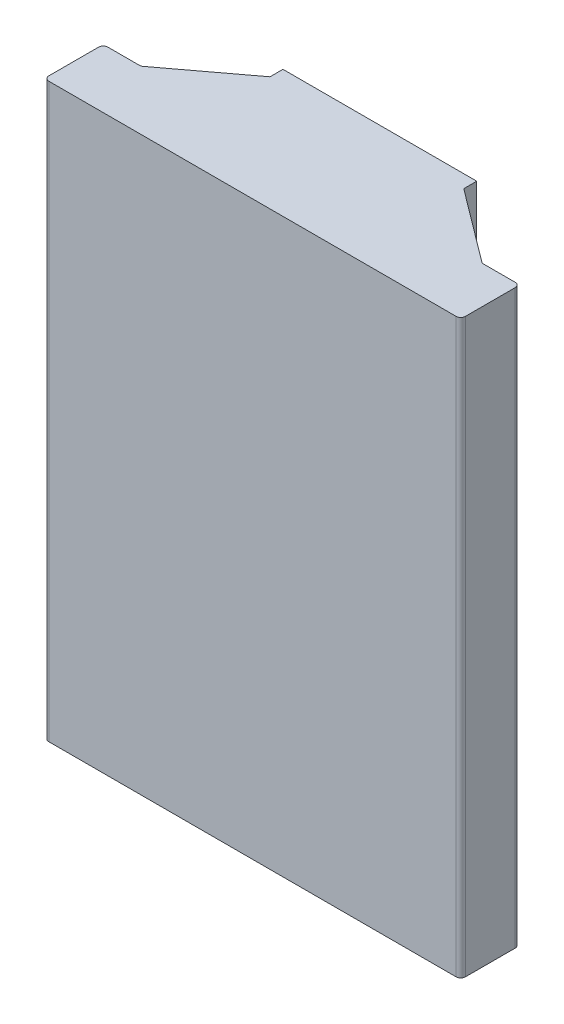
ISO-10303-21;
HEADER;
FILE_DESCRIPTION(('STEP AP214'),'2;1');
FILE_NAME('part.step','',(''),(''),'','','');
FILE_SCHEMA(('AUTOMOTIVE_DESIGN { 1 0 10303 214 1 1 1 1 }'));
ENDSEC;
DATA;
#1=APPLICATION_CONTEXT('core data for automotive mechanical design processes');
#2=APPLICATION_PROTOCOL_DEFINITION('international standard','automotive_design',2000,#1);
#3=PRODUCT_CONTEXT('',#1,'mechanical');
#4=PRODUCT('Part','Part','',(#3));
#5=PRODUCT_RELATED_PRODUCT_CATEGORY('part','',(#4));
#6=PRODUCT_DEFINITION_FORMATION('','',#4);
#7=PRODUCT_DEFINITION_CONTEXT('part definition',#1,'design');
#8=PRODUCT_DEFINITION('design','',#6,#7);
#9=PRODUCT_DEFINITION_SHAPE('','',#8);
#10=(LENGTH_UNIT() NAMED_UNIT(*) SI_UNIT(.MILLI.,.METRE.));
#11=(NAMED_UNIT(*) PLANE_ANGLE_UNIT() SI_UNIT($,.RADIAN.));
#12=(NAMED_UNIT(*) SI_UNIT($,.STERADIAN.) SOLID_ANGLE_UNIT());
#13=UNCERTAINTY_MEASURE_WITH_UNIT(LENGTH_MEASURE(1.E-05),#10,'distance_accuracy_value','');
#14=(GEOMETRIC_REPRESENTATION_CONTEXT(3) GLOBAL_UNCERTAINTY_ASSIGNED_CONTEXT((#13)) GLOBAL_UNIT_ASSIGNED_CONTEXT((#10,
#11,#12)) REPRESENTATION_CONTEXT('',''));
#15=CARTESIAN_POINT('',(0.,0.,0.));
#16=DIRECTION('',(0.,0.,1.));
#17=DIRECTION('',(1.,0.,0.));
#18=AXIS2_PLACEMENT_3D('',#15,#16,#17);
#19=CARTESIAN_POINT('',(20.575,60.,-2.40000000000001));
#20=DIRECTION('',(0.,0.,-1.));
#21=DIRECTION('',(-1.,0.,0.));
#22=AXIS2_PLACEMENT_3D('',#19,#20,#21);
#23=PLANE('',#22);
#24=DIRECTION('',(1.,0.,0.));
#25=VECTOR('',#24,1.);
#26=CARTESIAN_POINT('',(20.575,0.,-2.40000000000001));
#27=LINE('',#26,#25);
#28=CARTESIAN_POINT('',(17.825,0.,-2.40000000000001));
#29=VERTEX_POINT('',#28);
#30=CARTESIAN_POINT('',(20.075,0.,-2.40000000000001));
#31=VERTEX_POINT('',#30);
#32=EDGE_CURVE('E301',#29,#31,#27,.T.);
#33=ORIENTED_EDGE('',*,*,#32,.T.);
#34=DIRECTION('',(0.,-1.,0.));
#35=VECTOR('',#34,1.);
#36=CARTESIAN_POINT('',(20.075,60.,-2.40000000000001));
#37=LINE('',#36,#35);
#38=CARTESIAN_POINT('',(20.075,60.,-2.40000000000001));
#39=VERTEX_POINT('',#38);
#40=EDGE_CURVE('E525',#31,#39,#37,.F.);
#41=ORIENTED_EDGE('',*,*,#40,.T.);
#42=DIRECTION('',(1.,0.,0.));
#43=VECTOR('',#42,1.);
#44=CARTESIAN_POINT('',(20.575,60.,-2.40000000000001));
#45=LINE('',#44,#43);
#46=CARTESIAN_POINT('',(17.825,60.,-2.40000000000001));
#47=VERTEX_POINT('',#46);
#48=EDGE_CURVE('E307',#47,#39,#45,.T.);
#49=ORIENTED_EDGE('',*,*,#48,.F.);
#50=DIRECTION('',(0.,-1.,0.));
#51=VECTOR('',#50,1.);
#52=CARTESIAN_POINT('',(17.825,60.,-2.40000000000001));
#53=LINE('',#52,#51);
#54=EDGE_CURVE('E340',#47,#29,#53,.T.);
#55=ORIENTED_EDGE('',*,*,#54,.T.);
#56=EDGE_LOOP('',(#33,#41,#49,#55));
#57=FACE_BOUND('',#56,.T.);
#58=ADVANCED_FACE('F45',(#57),#23,.F.);
#59=CARTESIAN_POINT('',(20.575,60.,0.));
#60=DIRECTION('',(1.,0.,0.));
#61=DIRECTION('',(0.,0.,-1.));
#62=AXIS2_PLACEMENT_3D('',#59,#60,#61);
#63=PLANE('',#62);
#64=DIRECTION('',(0.,0.,1.));
#65=VECTOR('',#64,1.);
#66=CARTESIAN_POINT('',(20.575,60.,0.));
#67=LINE('',#66,#65);
#68=CARTESIAN_POINT('',(20.575,60.,-1.90000000000001));
#69=VERTEX_POINT('',#68);
#70=CARTESIAN_POINT('',(20.575,60.,-0.500000000000008));
#71=VERTEX_POINT('',#70);
#72=EDGE_CURVE('E311',#69,#71,#67,.T.);
#73=ORIENTED_EDGE('',*,*,#72,.F.);
#74=DIRECTION('',(0.,-1.,0.));
#75=VECTOR('',#74,1.);
#76=CARTESIAN_POINT('',(20.575,0.,-1.90000000000001));
#77=LINE('',#76,#75);
#78=CARTESIAN_POINT('',(20.575,0.,-1.90000000000001));
#79=VERTEX_POINT('',#78);
#80=EDGE_CURVE('E521',#69,#79,#77,.T.);
#81=ORIENTED_EDGE('',*,*,#80,.T.);
#82=DIRECTION('',(0.,0.,1.));
#83=VECTOR('',#82,1.);
#84=CARTESIAN_POINT('',(20.575,0.,0.));
#85=LINE('',#84,#83);
#86=CARTESIAN_POINT('',(20.575,0.,-0.500000000000008));
#87=VERTEX_POINT('',#86);
#88=EDGE_CURVE('E344',#79,#87,#85,.T.);
#89=ORIENTED_EDGE('',*,*,#88,.T.);
#90=DIRECTION('',(0.,-1.,0.));
#91=VECTOR('',#90,1.);
#92=CARTESIAN_POINT('',(20.575,60.,-0.500000000000008));
#93=LINE('',#92,#91);
#94=EDGE_CURVE('E518',#87,#71,#93,.F.);
#95=ORIENTED_EDGE('',*,*,#94,.T.);
#96=EDGE_LOOP('',(#73,#81,#89,#95));
#97=FACE_BOUND('',#96,.T.);
#98=ADVANCED_FACE('F643',(#97),#63,.F.);
#99=CARTESIAN_POINT('',(-20.575,60.,0.));
#100=DIRECTION('',(0.,0.,1.));
#101=DIRECTION('',(1.,0.,0.));
#102=AXIS2_PLACEMENT_3D('',#99,#100,#101);
#103=PLANE('',#102);
#104=DIRECTION('',(-1.,0.,0.));
#105=VECTOR('',#104,1.);
#106=CARTESIAN_POINT('',(-20.575,60.,0.));
#107=LINE('',#106,#105);
#108=CARTESIAN_POINT('',(20.075,60.,0.));
#109=VERTEX_POINT('',#108);
#110=CARTESIAN_POINT('',(-20.075,60.,0.));
#111=VERTEX_POINT('',#110);
#112=EDGE_CURVE('E316',#109,#111,#107,.T.);
#113=ORIENTED_EDGE('',*,*,#112,.F.);
#114=DIRECTION('',(0.,-1.,0.));
#115=VECTOR('',#114,1.);
#116=CARTESIAN_POINT('',(20.075,0.,0.));
#117=LINE('',#116,#115);
#118=CARTESIAN_POINT('',(20.075,0.,0.));
#119=VERTEX_POINT('',#118);
#120=EDGE_CURVE('E542',#109,#119,#117,.T.);
#121=ORIENTED_EDGE('',*,*,#120,.T.);
#122=DIRECTION('',(-1.,0.,0.));
#123=VECTOR('',#122,1.);
#124=CARTESIAN_POINT('',(-20.575,0.,0.));
#125=LINE('',#124,#123);
#126=CARTESIAN_POINT('',(-20.075,0.,0.));
#127=VERTEX_POINT('',#126);
#128=EDGE_CURVE('E348',#119,#127,#125,.T.);
#129=ORIENTED_EDGE('',*,*,#128,.T.);
#130=DIRECTION('',(0.,-1.,0.));
#131=VECTOR('',#130,1.);
#132=CARTESIAN_POINT('',(-20.075,60.,0.));
#133=LINE('',#132,#131);
#134=EDGE_CURVE('E539',#127,#111,#133,.F.);
#135=ORIENTED_EDGE('',*,*,#134,.T.);
#136=EDGE_LOOP('',(#113,#121,#129,#135));
#137=FACE_BOUND('',#136,.T.);
#138=ADVANCED_FACE('F589',(#137),#103,.F.);
#139=CARTESIAN_POINT('',(-20.575,60.,0.));
#140=DIRECTION('',(-1.,0.,0.));
#141=DIRECTION('',(0.,0.,1.));
#142=AXIS2_PLACEMENT_3D('',#139,#140,#141);
#143=PLANE('',#142);
#144=DIRECTION('',(0.,0.,-1.));
#145=VECTOR('',#144,1.);
#146=CARTESIAN_POINT('',(-20.575,60.,0.));
#147=LINE('',#146,#145);
#148=CARTESIAN_POINT('',(-20.575,60.,-0.5));
#149=VERTEX_POINT('',#148);
#150=CARTESIAN_POINT('',(-20.575,60.,-1.9));
#151=VERTEX_POINT('',#150);
#152=EDGE_CURVE('E320',#149,#151,#147,.T.);
#153=ORIENTED_EDGE('',*,*,#152,.F.);
#154=DIRECTION('',(0.,-1.,0.));
#155=VECTOR('',#154,1.);
#156=CARTESIAN_POINT('',(-20.575,0.,-0.5));
#157=LINE('',#156,#155);
#158=CARTESIAN_POINT('',(-20.575,0.,-0.5));
#159=VERTEX_POINT('',#158);
#160=EDGE_CURVE('E548',#149,#159,#157,.T.);
#161=ORIENTED_EDGE('',*,*,#160,.T.);
#162=DIRECTION('',(0.,0.,-1.));
#163=VECTOR('',#162,1.);
#164=CARTESIAN_POINT('',(-20.575,0.,0.));
#165=LINE('',#164,#163);
#166=CARTESIAN_POINT('',(-20.575,0.,-1.9));
#167=VERTEX_POINT('',#166);
#168=EDGE_CURVE('E352',#159,#167,#165,.T.);
#169=ORIENTED_EDGE('',*,*,#168,.T.);
#170=DIRECTION('',(0.,-1.,0.));
#171=VECTOR('',#170,1.);
#172=CARTESIAN_POINT('',(-20.575,60.,-1.9));
#173=LINE('',#172,#171);
#174=EDGE_CURVE('E69',#167,#151,#173,.F.);
#175=ORIENTED_EDGE('',*,*,#174,.T.);
#176=EDGE_LOOP('',(#153,#161,#169,#175));
#177=FACE_BOUND('',#176,.T.);
#178=ADVANCED_FACE('F594',(#177),#143,.F.);
#179=CARTESIAN_POINT('',(-20.575,60.,-2.4));
#180=DIRECTION('',(0.,0.,-1.));
#181=DIRECTION('',(-1.,0.,0.));
#182=AXIS2_PLACEMENT_3D('',#179,#180,#181);
#183=PLANE('',#182);
#184=DIRECTION('',(1.,0.,0.));
#185=VECTOR('',#184,1.);
#186=CARTESIAN_POINT('',(-20.575,60.,-2.4));
#187=LINE('',#186,#185);
#188=CARTESIAN_POINT('',(-20.075,60.,-2.4));
#189=VERTEX_POINT('',#188);
#190=CARTESIAN_POINT('',(-17.825,60.,-2.4));
#191=VERTEX_POINT('',#190);
#192=EDGE_CURVE('E323',#189,#191,#187,.T.);
#193=ORIENTED_EDGE('',*,*,#192,.F.);
#194=DIRECTION('',(0.,-1.,0.));
#195=VECTOR('',#194,1.);
#196=CARTESIAN_POINT('',(-20.075,0.,-2.4));
#197=LINE('',#196,#195);
#198=CARTESIAN_POINT('',(-20.075,0.,-2.4));
#199=VERTEX_POINT('',#198);
#200=EDGE_CURVE('E552',#189,#199,#197,.T.);
#201=ORIENTED_EDGE('',*,*,#200,.T.);
#202=DIRECTION('',(1.,0.,0.));
#203=VECTOR('',#202,1.);
#204=CARTESIAN_POINT('',(-20.575,0.,-2.4));
#205=LINE('',#204,#203);
#206=CARTESIAN_POINT('',(-17.825,0.,-2.4));
#207=VERTEX_POINT('',#206);
#208=EDGE_CURVE('E355',#199,#207,#205,.T.);
#209=ORIENTED_EDGE('',*,*,#208,.T.);
#210=DIRECTION('',(0.,-1.,0.));
#211=VECTOR('',#210,1.);
#212=CARTESIAN_POINT('',(-17.825,60.,-2.4));
#213=LINE('',#212,#211);
#214=EDGE_CURVE('E429',#191,#207,#213,.T.);
#215=ORIENTED_EDGE('',*,*,#214,.F.);
#216=EDGE_LOOP('',(#193,#201,#209,#215));
#217=FACE_BOUND('',#216,.T.);
#218=ADVANCED_FACE('F599',(#217),#183,.F.);
#219=CARTESIAN_POINT('',(-17.825,60.,-2.4));
#220=DIRECTION('',(-0.60034299797664,0.,-0.79974263659031));
#221=DIRECTION('',(-0.79974263659031,0.,0.60034299797664));
#222=AXIS2_PLACEMENT_3D('',#219,#220,#221);
#223=PLANE('',#222);
#224=DIRECTION('',(0.79974263659031,0.,-0.60034299797664));
#225=VECTOR('',#224,1.);
#226=CARTESIAN_POINT('',(-17.825,0.,-2.4));
#227=LINE('',#226,#225);
#228=CARTESIAN_POINT('',(-8.69982850101168,0.,-9.24999469092957));
#229=VERTEX_POINT('',#228);
#230=EDGE_CURVE('E358',#207,#229,#227,.T.);
#231=ORIENTED_EDGE('',*,*,#230,.T.);
#232=DIRECTION('',(0.,-1.,0.));
#233=VECTOR('',#232,1.);
#234=CARTESIAN_POINT('',(-8.69982850101168,60.,-9.24999469092957));
#235=LINE('',#234,#233);
#236=CARTESIAN_POINT('',(-8.69982850101168,60.,-9.24999469092957));
#237=VERTEX_POINT('',#236);
#238=EDGE_CURVE('E462',#229,#237,#235,.F.);
#239=ORIENTED_EDGE('',*,*,#238,.T.);
#240=DIRECTION('',(0.79974263659031,0.,-0.60034299797664));
#241=VECTOR('',#240,1.);
#242=CARTESIAN_POINT('',(-17.825,60.,-2.4));
#243=LINE('',#242,#241);
#244=EDGE_CURVE('E326',#191,#237,#243,.T.);
#245=ORIENTED_EDGE('',*,*,#244,.F.);
#246=ORIENTED_EDGE('',*,*,#214,.T.);
#247=EDGE_LOOP('',(#231,#239,#245,#246));
#248=FACE_BOUND('',#247,.T.);
#249=ADVANCED_FACE('F605',(#248),#223,.F.);
#250=CARTESIAN_POINT('',(-8.5,60.,-11.8050442410754));
#251=DIRECTION('',(-1.,0.,0.));
#252=DIRECTION('',(0.,0.,1.));
#253=AXIS2_PLACEMENT_3D('',#250,#251,#252);
#254=PLANE('',#253);
#255=DIRECTION('',(0.,0.,-1.));
#256=VECTOR('',#255,1.);
#257=CARTESIAN_POINT('',(-8.5,60.,-11.8050442410754));
#258=LINE('',#257,#256);
#259=CARTESIAN_POINT('',(-8.5,60.,-9.64986600922473));
#260=VERTEX_POINT('',#259);
#261=CARTESIAN_POINT('',(-8.5,60.,-11.8050442410754));
#262=VERTEX_POINT('',#261);
#263=EDGE_CURVE('E330',#260,#262,#258,.T.);
#264=ORIENTED_EDGE('',*,*,#263,.F.);
#265=DIRECTION('',(0.,-1.,0.));
#266=VECTOR('',#265,1.);
#267=CARTESIAN_POINT('',(-8.5,60.,-9.64986600922473));
#268=LINE('',#267,#266);
#269=CARTESIAN_POINT('',(-8.5,0.,-9.64986600922473));
#270=VERTEX_POINT('',#269);
#271=EDGE_CURVE('E458',#260,#270,#268,.T.);
#272=ORIENTED_EDGE('',*,*,#271,.T.);
#273=DIRECTION('',(0.,0.,-1.));
#274=VECTOR('',#273,1.);
#275=CARTESIAN_POINT('',(-8.5,0.,-11.8050442410754));
#276=LINE('',#275,#274);
#277=CARTESIAN_POINT('',(-8.5,0.,-11.8050442410754));
#278=VERTEX_POINT('',#277);
#279=EDGE_CURVE('E362',#270,#278,#276,.T.);
#280=ORIENTED_EDGE('',*,*,#279,.T.);
#281=DIRECTION('',(0.,-1.,0.));
#282=VECTOR('',#281,1.);
#283=CARTESIAN_POINT('',(-8.5,60.,-11.8050442410754));
#284=LINE('',#283,#282);
#285=EDGE_CURVE('E425',#262,#278,#284,.T.);
#286=ORIENTED_EDGE('',*,*,#285,.F.);
#287=EDGE_LOOP('',(#264,#272,#280,#286));
#288=FACE_BOUND('',#287,.T.);
#289=ADVANCED_FACE('F615',(#288),#254,.F.);
#290=CARTESIAN_POINT('',(-10.5,60.,-10.3994640368989));
#291=DIRECTION('',(1.,0.,0.));
#292=DIRECTION('',(0.,0.,-1.));
#293=AXIS2_PLACEMENT_3D('',#290,#291,#292);
#294=PLANE('',#293);
#295=DIRECTION('',(0.,0.,1.));
#296=VECTOR('',#295,1.);
#297=CARTESIAN_POINT('',(-10.5,0.,-10.3994640368989));
#298=LINE('',#297,#296);
#299=CARTESIAN_POINT('',(-10.5,0.,-11.8050442410754));
#300=VERTEX_POINT('',#299);
#301=CARTESIAN_POINT('',(-10.5,0.,-10.3994640368989));
#302=VERTEX_POINT('',#301);
#303=EDGE_CURVE('E368',#300,#302,#298,.T.);
#304=ORIENTED_EDGE('',*,*,#303,.T.);
#305=DIRECTION('',(0.,-1.,0.));
#306=VECTOR('',#305,1.);
#307=CARTESIAN_POINT('',(-10.5,60.,-10.3994640368989));
#308=LINE('',#307,#306);
#309=CARTESIAN_POINT('',(-10.5,62.,-10.3994640368989));
#310=VERTEX_POINT('',#309);
#311=EDGE_CURVE('E281',#310,#302,#308,.T.);
#312=ORIENTED_EDGE('',*,*,#311,.F.);
#313=DIRECTION('',(0.,0.,1.));
#314=VECTOR('',#313,1.);
#315=CARTESIAN_POINT('',(-10.5,62.,-11.8050442410754));
#316=LINE('',#315,#314);
#317=CARTESIAN_POINT('',(-10.5,62.,-11.8050442410754));
#318=VERTEX_POINT('',#317);
#319=EDGE_CURVE('E290',#318,#310,#316,.T.);
#320=ORIENTED_EDGE('',*,*,#319,.F.);
#321=DIRECTION('',(0.,-1.,0.));
#322=VECTOR('',#321,1.);
#323=CARTESIAN_POINT('',(-10.5,60.,-11.8050442410754));
#324=LINE('',#323,#322);
#325=EDGE_CURVE('E421',#318,#300,#324,.T.);
#326=ORIENTED_EDGE('',*,*,#325,.T.);
#327=EDGE_LOOP('',(#304,#312,#320,#326));
#328=FACE_BOUND('',#327,.T.);
#329=ADVANCED_FACE('F725',(#328),#294,.F.);
#330=CARTESIAN_POINT('',(-10.5,60.,-10.3994640368989));
#331=DIRECTION('',(0.60034299797664,0.,0.79974263659031));
#332=DIRECTION('',(0.79974263659031,0.,-0.60034299797664));
#333=AXIS2_PLACEMENT_3D('',#330,#331,#332);
#334=PLANE('',#333);
#335=DIRECTION('',(-0.79974263659031,0.,0.60034299797664));
#336=VECTOR('',#335,1.);
#337=CARTESIAN_POINT('',(-10.5,0.,-10.3994640368989));
#338=LINE('',#337,#336);
#339=CARTESIAN_POINT('',(-18.3587574553121,0.,-4.50012868170484));
#340=VERTEX_POINT('',#339);
#341=EDGE_CURVE('E371',#302,#340,#338,.T.);
#342=ORIENTED_EDGE('',*,*,#341,.T.);
#343=DIRECTION('',(0.,-1.,0.));
#344=VECTOR('',#343,1.);
#345=CARTESIAN_POINT('',(-18.3587574553121,62.,-4.50012868170484));
#346=LINE('',#345,#344);
#347=CARTESIAN_POINT('',(-18.3587574553121,62.,-4.50012868170484));
#348=VERTEX_POINT('',#347);
#349=EDGE_CURVE('E472',#340,#348,#346,.F.);
#350=ORIENTED_EDGE('',*,*,#349,.T.);
#351=DIRECTION('',(-0.79974263659031,0.,0.60034299797664));
#352=VECTOR('',#351,1.);
#353=CARTESIAN_POINT('',(-10.5,62.,-10.3994640368989));
#354=LINE('',#353,#352);
#355=EDGE_CURVE('E297',#310,#348,#354,.T.);
#356=ORIENTED_EDGE('',*,*,#355,.F.);
#357=ORIENTED_EDGE('',*,*,#311,.T.);
#358=EDGE_LOOP('',(#342,#350,#356,#357));
#359=FACE_BOUND('',#358,.T.);
#360=ADVANCED_FACE('F729',(#359),#334,.F.);
#361=CARTESIAN_POINT('',(-18.4921431634403,60.,-4.4));
#362=DIRECTION('',(0.,0.,1.));
#363=DIRECTION('',(1.,0.,0.));
#364=AXIS2_PLACEMENT_3D('',#361,#362,#363);
#365=PLANE('',#364);
#366=DIRECTION('',(-1.,0.,0.));
#367=VECTOR('',#366,1.);
#368=CARTESIAN_POINT('',(-18.4921431634403,62.,-4.4));
#369=LINE('',#368,#367);
#370=CARTESIAN_POINT('',(-18.6589289543004,62.,-4.4));
#371=VERTEX_POINT('',#370);
#372=CARTESIAN_POINT('',(-22.075,62.,-4.4));
#373=VERTEX_POINT('',#372);
#374=EDGE_CURVE('E306',#371,#373,#369,.T.);
#375=ORIENTED_EDGE('',*,*,#374,.F.);
#376=DIRECTION('',(0.,-1.,0.));
#377=VECTOR('',#376,1.);
#378=CARTESIAN_POINT('',(-18.6589289543004,0.,-4.4));
#379=LINE('',#378,#377);
#380=CARTESIAN_POINT('',(-18.6589289543004,0.,-4.4));
#381=VERTEX_POINT('',#380);
#382=EDGE_CURVE('E468',#371,#381,#379,.T.);
#383=ORIENTED_EDGE('',*,*,#382,.T.);
#384=DIRECTION('',(-1.,0.,0.));
#385=VECTOR('',#384,1.);
#386=CARTESIAN_POINT('',(-18.4921431634403,0.,-4.4));
#387=LINE('',#386,#385);
#388=CARTESIAN_POINT('',(-22.075,0.,-4.4));
#389=VERTEX_POINT('',#388);
#390=EDGE_CURVE('E375',#381,#389,#387,.T.);
#391=ORIENTED_EDGE('',*,*,#390,.T.);
#392=DIRECTION('',(0.,-1.,0.));
#393=VECTOR('',#392,1.);
#394=CARTESIAN_POINT('',(-22.075,60.,-4.4));
#395=LINE('',#394,#393);
#396=EDGE_CURVE('E465',#389,#373,#395,.F.);
#397=ORIENTED_EDGE('',*,*,#396,.T.);
#398=EDGE_LOOP('',(#375,#383,#391,#397));
#399=FACE_BOUND('',#398,.T.);
#400=ADVANCED_FACE('F736',(#399),#365,.F.);
#401=CARTESIAN_POINT('',(-22.575,60.,-4.4));
#402=DIRECTION('',(1.,0.,0.));
#403=DIRECTION('',(0.,0.,-1.));
#404=AXIS2_PLACEMENT_3D('',#401,#402,#403);
#405=PLANE('',#404);
#406=DIRECTION('',(0.,0.,1.));
#407=VECTOR('',#406,1.);
#408=CARTESIAN_POINT('',(-22.575,62.,-4.4));
#409=LINE('',#408,#407);
#410=CARTESIAN_POINT('',(-22.575,62.,-3.9));
#411=VERTEX_POINT('',#410);
#412=CARTESIAN_POINT('',(-22.575,62.,1.5));
#413=VERTEX_POINT('',#412);
#414=EDGE_CURVE('E701',#411,#413,#409,.T.);
#415=ORIENTED_EDGE('',*,*,#414,.F.);
#416=DIRECTION('',(0.,-1.,0.));
#417=VECTOR('',#416,1.);
#418=CARTESIAN_POINT('',(-22.575,60.,-3.9));
#419=LINE('',#418,#417);
#420=CARTESIAN_POINT('',(-22.575,0.,-3.9));
#421=VERTEX_POINT('',#420);
#422=EDGE_CURVE('E514',#411,#421,#419,.T.);
#423=ORIENTED_EDGE('',*,*,#422,.T.);
#424=DIRECTION('',(0.,0.,1.));
#425=VECTOR('',#424,1.);
#426=CARTESIAN_POINT('',(-22.575,0.,-4.4));
#427=LINE('',#426,#425);
#428=CARTESIAN_POINT('',(-22.575,0.,1.5));
#429=VERTEX_POINT('',#428);
#430=EDGE_CURVE('E379',#421,#429,#427,.T.);
#431=ORIENTED_EDGE('',*,*,#430,.T.);
#432=DIRECTION('',(0.,-1.,0.));
#433=VECTOR('',#432,1.);
#434=CARTESIAN_POINT('',(-22.575,60.,1.5));
#435=LINE('',#434,#433);
#436=EDGE_CURVE('E511',#429,#413,#435,.F.);
#437=ORIENTED_EDGE('',*,*,#436,.T.);
#438=EDGE_LOOP('',(#415,#423,#431,#437));
#439=FACE_BOUND('',#438,.T.);
#440=ADVANCED_FACE('F744',(#439),#405,.F.);
#441=CARTESIAN_POINT('',(-22.575,60.,2.));
#442=DIRECTION('',(0.,0.,-1.));
#443=DIRECTION('',(-1.,0.,0.));
#444=AXIS2_PLACEMENT_3D('',#441,#442,#443);
#445=PLANE('',#444);
#446=DIRECTION('',(1.,0.,0.));
#447=VECTOR('',#446,1.);
#448=CARTESIAN_POINT('',(-22.575,0.,2.));
#449=LINE('',#448,#447);
#450=CARTESIAN_POINT('',(-22.075,0.,2.));
#451=VERTEX_POINT('',#450);
#452=CARTESIAN_POINT('',(22.075,0.,2.));
#453=VERTEX_POINT('',#452);
#454=EDGE_CURVE('E383',#451,#453,#449,.T.);
#455=ORIENTED_EDGE('',*,*,#454,.T.);
#456=DIRECTION('',(0.,-1.,0.));
#457=VECTOR('',#456,1.);
#458=CARTESIAN_POINT('',(22.075,60.,2.));
#459=LINE('',#458,#457);
#460=CARTESIAN_POINT('',(22.075,62.,2.));
#461=VERTEX_POINT('',#460);
#462=EDGE_CURVE('E508',#453,#461,#459,.F.);
#463=ORIENTED_EDGE('',*,*,#462,.T.);
#464=DIRECTION('',(1.,0.,0.));
#465=VECTOR('',#464,1.);
#466=CARTESIAN_POINT('',(-22.575,62.,2.));
#467=LINE('',#466,#465);
#468=CARTESIAN_POINT('',(-22.075,62.,2.));
#469=VERTEX_POINT('',#468);
#470=EDGE_CURVE('E698',#469,#461,#467,.T.);
#471=ORIENTED_EDGE('',*,*,#470,.F.);
#472=DIRECTION('',(0.,-1.,0.));
#473=VECTOR('',#472,1.);
#474=CARTESIAN_POINT('',(-22.075,60.,2.));
#475=LINE('',#474,#473);
#476=EDGE_CURVE('E504',#469,#451,#475,.T.);
#477=ORIENTED_EDGE('',*,*,#476,.T.);
#478=EDGE_LOOP('',(#455,#463,#471,#477));
#479=FACE_BOUND('',#478,.T.);
#480=ADVANCED_FACE('F703',(#479),#445,.F.);
#481=CARTESIAN_POINT('',(22.575,60.,2.));
#482=DIRECTION('',(-1.,0.,0.));
#483=DIRECTION('',(0.,0.,1.));
#484=AXIS2_PLACEMENT_3D('',#481,#482,#483);
#485=PLANE('',#484);
#486=DIRECTION('',(0.,0.,-1.));
#487=VECTOR('',#486,1.);
#488=CARTESIAN_POINT('',(22.575,0.,2.));
#489=LINE('',#488,#487);
#490=CARTESIAN_POINT('',(22.575,0.,1.5));
#491=VERTEX_POINT('',#490);
#492=CARTESIAN_POINT('',(22.575,0.,-3.9));
#493=VERTEX_POINT('',#492);
#494=EDGE_CURVE('E387',#491,#493,#489,.T.);
#495=ORIENTED_EDGE('',*,*,#494,.T.);
#496=DIRECTION('',(0.,-1.,0.));
#497=VECTOR('',#496,1.);
#498=CARTESIAN_POINT('',(22.575,60.,-3.9));
#499=LINE('',#498,#497);
#500=CARTESIAN_POINT('',(22.575,62.,-3.9));
#501=VERTEX_POINT('',#500);
#502=EDGE_CURVE('E489',#493,#501,#499,.F.);
#503=ORIENTED_EDGE('',*,*,#502,.T.);
#504=DIRECTION('',(0.,0.,-1.));
#505=VECTOR('',#504,1.);
#506=CARTESIAN_POINT('',(22.575,62.,2.));
#507=LINE('',#506,#505);
#508=CARTESIAN_POINT('',(22.575,62.,1.5));
#509=VERTEX_POINT('',#508);
#510=EDGE_CURVE('E707',#509,#501,#507,.T.);
#511=ORIENTED_EDGE('',*,*,#510,.F.);
#512=DIRECTION('',(0.,-1.,0.));
#513=VECTOR('',#512,1.);
#514=CARTESIAN_POINT('',(22.575,60.,1.5));
#515=LINE('',#514,#513);
#516=EDGE_CURVE('E485',#509,#491,#515,.T.);
#517=ORIENTED_EDGE('',*,*,#516,.T.);
#518=EDGE_LOOP('',(#495,#503,#511,#517));
#519=FACE_BOUND('',#518,.T.);
#520=ADVANCED_FACE('F749',(#519),#485,.F.);
#521=CARTESIAN_POINT('',(22.575,60.,-4.4));
#522=DIRECTION('',(0.,0.,1.));
#523=DIRECTION('',(1.,0.,0.));
#524=AXIS2_PLACEMENT_3D('',#521,#522,#523);
#525=PLANE('',#524);
#526=DIRECTION('',(-1.,0.,0.));
#527=VECTOR('',#526,1.);
#528=CARTESIAN_POINT('',(22.575,0.,-4.4));
#529=LINE('',#528,#527);
#530=CARTESIAN_POINT('',(22.075,0.,-4.4));
#531=VERTEX_POINT('',#530);
#532=CARTESIAN_POINT('',(18.6589289543004,0.,-4.4));
#533=VERTEX_POINT('',#532);
#534=EDGE_CURVE('E391',#531,#533,#529,.T.);
#535=ORIENTED_EDGE('',*,*,#534,.T.);
#536=DIRECTION('',(0.,-1.,0.));
#537=VECTOR('',#536,1.);
#538=CARTESIAN_POINT('',(18.6589289543004,62.,-4.4));
#539=LINE('',#538,#537);
#540=CARTESIAN_POINT('',(18.6589289543004,62.,-4.4));
#541=VERTEX_POINT('',#540);
#542=EDGE_CURVE('E482',#533,#541,#539,.F.);
#543=ORIENTED_EDGE('',*,*,#542,.T.);
#544=DIRECTION('',(-1.,0.,0.));
#545=VECTOR('',#544,1.);
#546=CARTESIAN_POINT('',(22.575,62.,-4.4));
#547=LINE('',#546,#545);
#548=CARTESIAN_POINT('',(22.075,62.,-4.4));
#549=VERTEX_POINT('',#548);
#550=EDGE_CURVE('E271',#549,#541,#547,.T.);
#551=ORIENTED_EDGE('',*,*,#550,.F.);
#552=DIRECTION('',(0.,-1.,0.));
#553=VECTOR('',#552,1.);
#554=CARTESIAN_POINT('',(22.075,60.,-4.4));
#555=LINE('',#554,#553);
#556=EDGE_CURVE('E478',#549,#531,#555,.T.);
#557=ORIENTED_EDGE('',*,*,#556,.T.);
#558=EDGE_LOOP('',(#535,#543,#551,#557));
#559=FACE_BOUND('',#558,.T.);
#560=ADVANCED_FACE('F751',(#559),#525,.F.);
#561=CARTESIAN_POINT('',(18.4921431634403,60.,-4.4));
#562=DIRECTION('',(-0.60034299797664,0.,0.79974263659031));
#563=DIRECTION('',(0.79974263659031,0.,0.60034299797664));
#564=AXIS2_PLACEMENT_3D('',#561,#562,#563);
#565=PLANE('',#564);
#566=DIRECTION('',(-0.79974263659031,0.,-0.60034299797664));
#567=VECTOR('',#566,1.);
#568=CARTESIAN_POINT('',(18.4921431634403,62.,-4.4));
#569=LINE('',#568,#567);
#570=CARTESIAN_POINT('',(18.3587574553121,62.,-4.50012868170484));
#571=VERTEX_POINT('',#570);
#572=CARTESIAN_POINT('',(10.5,62.,-10.3994640368989));
#573=VERTEX_POINT('',#572);
#574=EDGE_CURVE('E256',#571,#573,#569,.T.);
#575=ORIENTED_EDGE('',*,*,#574,.F.);
#576=DIRECTION('',(0.,-1.,0.));
#577=VECTOR('',#576,1.);
#578=CARTESIAN_POINT('',(18.3587574553121,0.,-4.50012868170484));
#579=LINE('',#578,#577);
#580=CARTESIAN_POINT('',(18.3587574553121,0.,-4.50012868170484));
#581=VERTEX_POINT('',#580);
#582=EDGE_CURVE('E475',#571,#581,#579,.T.);
#583=ORIENTED_EDGE('',*,*,#582,.T.);
#584=DIRECTION('',(-0.79974263659031,0.,-0.60034299797664));
#585=VECTOR('',#584,1.);
#586=CARTESIAN_POINT('',(18.4921431634403,0.,-4.4));
#587=LINE('',#586,#585);
#588=CARTESIAN_POINT('',(10.5,0.,-10.3994640368989));
#589=VERTEX_POINT('',#588);
#590=EDGE_CURVE('E277',#581,#589,#587,.T.);
#591=ORIENTED_EDGE('',*,*,#590,.T.);
#592=DIRECTION('',(0.,-1.,0.));
#593=VECTOR('',#592,1.);
#594=CARTESIAN_POINT('',(10.5,60.,-10.3994640368989));
#595=LINE('',#594,#593);
#596=EDGE_CURVE('E274',#573,#589,#595,.T.);
#597=ORIENTED_EDGE('',*,*,#596,.F.);
#598=EDGE_LOOP('',(#575,#583,#591,#597));
#599=FACE_BOUND('',#598,.T.);
#600=ADVANCED_FACE('F275',(#599),#565,.F.);
#601=CARTESIAN_POINT('',(10.5,60.,-11.8050442410754));
#602=DIRECTION('',(-1.,0.,0.));
#603=DIRECTION('',(0.,0.,1.));
#604=AXIS2_PLACEMENT_3D('',#601,#602,#603);
#605=PLANE('',#604);
#606=DIRECTION('',(0.,0.,-1.));
#607=VECTOR('',#606,1.);
#608=CARTESIAN_POINT('',(10.5,0.,-11.8050442410754));
#609=LINE('',#608,#607);
#610=CARTESIAN_POINT('',(10.5,0.,-11.8050442410754));
#611=VERTEX_POINT('',#610);
#612=EDGE_CURVE('E397',#589,#611,#609,.T.);
#613=ORIENTED_EDGE('',*,*,#612,.T.);
#614=DIRECTION('',(0.,-1.,0.));
#615=VECTOR('',#614,1.);
#616=CARTESIAN_POINT('',(10.5,60.,-11.8050442410754));
#617=LINE('',#616,#615);
#618=CARTESIAN_POINT('',(10.5,62.,-11.8050442410754));
#619=VERTEX_POINT('',#618);
#620=EDGE_CURVE('E282',#619,#611,#617,.T.);
#621=ORIENTED_EDGE('',*,*,#620,.F.);
#622=DIRECTION('',(0.,0.,-1.));
#623=VECTOR('',#622,1.);
#624=CARTESIAN_POINT('',(10.5,62.,-10.3994640368989));
#625=LINE('',#624,#623);
#626=EDGE_CURVE('E262',#573,#619,#625,.T.);
#627=ORIENTED_EDGE('',*,*,#626,.F.);
#628=ORIENTED_EDGE('',*,*,#596,.T.);
#629=EDGE_LOOP('',(#613,#621,#627,#628));
#630=FACE_BOUND('',#629,.T.);
#631=ADVANCED_FACE('F284',(#630),#605,.F.);
#632=CARTESIAN_POINT('',(8.5,60.,-11.8050442410754));
#633=DIRECTION('',(0.,0.,1.));
#634=DIRECTION('',(1.,0.,0.));
#635=AXIS2_PLACEMENT_3D('',#632,#633,#634);
#636=PLANE('',#635);
#637=DIRECTION('',(-1.,0.,0.));
#638=VECTOR('',#637,1.);
#639=CARTESIAN_POINT('',(8.5,0.,-11.8050442410754));
#640=LINE('',#639,#638);
#641=CARTESIAN_POINT('',(8.5,0.,-11.8050442410754));
#642=VERTEX_POINT('',#641);
#643=EDGE_CURVE('E400',#611,#642,#640,.T.);
#644=ORIENTED_EDGE('',*,*,#643,.T.);
#645=DIRECTION('',(0.,-1.,0.));
#646=VECTOR('',#645,1.);
#647=CARTESIAN_POINT('',(8.5,60.,-11.8050442410754));
#648=LINE('',#647,#646);
#649=CARTESIAN_POINT('',(8.5,60.,-11.8050442410754));
#650=VERTEX_POINT('',#649);
#651=EDGE_CURVE('E412',#650,#642,#648,.T.);
#652=ORIENTED_EDGE('',*,*,#651,.F.);
#653=DIRECTION('',(-1.,0.,0.));
#654=VECTOR('',#653,1.);
#655=CARTESIAN_POINT('',(10.5,60.,-11.8050442410754));
#656=LINE('',#655,#654);
#657=EDGE_CURVE('E302',#650,#262,#656,.T.);
#658=ORIENTED_EDGE('',*,*,#657,.T.);
#659=ORIENTED_EDGE('',*,*,#285,.T.);
#660=DIRECTION('',(-1.,0.,0.));
#661=VECTOR('',#660,1.);
#662=CARTESIAN_POINT('',(-10.5,0.,-11.8050442410754));
#663=LINE('',#662,#661);
#664=EDGE_CURVE('E365',#278,#300,#663,.T.);
#665=ORIENTED_EDGE('',*,*,#664,.T.);
#666=ORIENTED_EDGE('',*,*,#325,.F.);
#667=DIRECTION('',(-1.,0.,0.));
#668=VECTOR('',#667,1.);
#669=CARTESIAN_POINT('',(10.5,62.,-11.8050442410754));
#670=LINE('',#669,#668);
#671=EDGE_CURVE('E287',#619,#318,#670,.T.);
#672=ORIENTED_EDGE('',*,*,#671,.F.);
#673=ORIENTED_EDGE('',*,*,#620,.T.);
#674=EDGE_LOOP('',(#644,#652,#658,#659,#665,#666,#672,#673));
#675=FACE_BOUND('',#674,.T.);
#676=ADVANCED_FACE('F618',(#675),#636,.F.);
#677=CARTESIAN_POINT('',(8.5,60.,-9.4));
#678=DIRECTION('',(1.,0.,0.));
#679=DIRECTION('',(0.,0.,-1.));
#680=AXIS2_PLACEMENT_3D('',#677,#678,#679);
#681=PLANE('',#680);
#682=DIRECTION('',(0.,0.,1.));
#683=VECTOR('',#682,1.);
#684=CARTESIAN_POINT('',(8.5,0.,-9.4));
#685=LINE('',#684,#683);
#686=CARTESIAN_POINT('',(8.5,0.,-9.64986600922473));
#687=VERTEX_POINT('',#686);
#688=EDGE_CURVE('E403',#642,#687,#685,.T.);
#689=ORIENTED_EDGE('',*,*,#688,.T.);
#690=DIRECTION('',(0.,-1.,0.));
#691=VECTOR('',#690,1.);
#692=CARTESIAN_POINT('',(8.5,60.,-9.64986600922473));
#693=LINE('',#692,#691);
#694=CARTESIAN_POINT('',(8.5,60.,-9.64986600922473));
#695=VERTEX_POINT('',#694);
#696=EDGE_CURVE('E455',#687,#695,#693,.F.);
#697=ORIENTED_EDGE('',*,*,#696,.T.);
#698=DIRECTION('',(0.,0.,1.));
#699=VECTOR('',#698,1.);
#700=CARTESIAN_POINT('',(8.5,60.,-9.4));
#701=LINE('',#700,#699);
#702=EDGE_CURVE('E333',#650,#695,#701,.T.);
#703=ORIENTED_EDGE('',*,*,#702,.F.);
#704=ORIENTED_EDGE('',*,*,#651,.T.);
#705=EDGE_LOOP('',(#689,#697,#703,#704));
#706=FACE_BOUND('',#705,.T.);
#707=ADVANCED_FACE('F867',(#706),#681,.F.);
#708=CARTESIAN_POINT('',(17.825,60.,-2.40000000000001));
#709=DIRECTION('',(0.60034299797664,0.,-0.79974263659031));
#710=DIRECTION('',(-0.79974263659031,0.,-0.60034299797664));
#711=AXIS2_PLACEMENT_3D('',#708,#709,#710);
#712=PLANE('',#711);
#713=DIRECTION('',(0.79974263659031,0.,0.60034299797664));
#714=VECTOR('',#713,1.);
#715=CARTESIAN_POINT('',(17.825,60.,-2.40000000000001));
#716=LINE('',#715,#714);
#717=CARTESIAN_POINT('',(8.69982850101168,60.,-9.24999469092957));
#718=VERTEX_POINT('',#717);
#719=EDGE_CURVE('E337',#718,#47,#716,.T.);
#720=ORIENTED_EDGE('',*,*,#719,.F.);
#721=DIRECTION('',(0.,-1.,0.));
#722=VECTOR('',#721,1.);
#723=CARTESIAN_POINT('',(8.69982850101168,60.,-9.24999469092957));
#724=LINE('',#723,#722);
#725=CARTESIAN_POINT('',(8.69982850101168,0.,-9.24999469092957));
#726=VERTEX_POINT('',#725);
#727=EDGE_CURVE('E433',#718,#726,#724,.T.);
#728=ORIENTED_EDGE('',*,*,#727,.T.);
#729=DIRECTION('',(0.79974263659031,0.,0.60034299797664));
#730=VECTOR('',#729,1.);
#731=CARTESIAN_POINT('',(17.825,0.,-2.40000000000001));
#732=LINE('',#731,#730);
#733=EDGE_CURVE('E312',#726,#29,#732,.T.);
#734=ORIENTED_EDGE('',*,*,#733,.T.);
#735=ORIENTED_EDGE('',*,*,#54,.F.);
#736=EDGE_LOOP('',(#720,#728,#734,#735));
#737=FACE_BOUND('',#736,.T.);
#738=ADVANCED_FACE('F628',(#737),#712,.F.);
#739=CARTESIAN_POINT('',(0.,0.,0.));
#740=DIRECTION('',(0.,-1.,0.));
#741=DIRECTION('',(0.,0.,-1.));
#742=AXIS2_PLACEMENT_3D('',#739,#740,#741);
#743=PLANE('',#742);
#744=ORIENTED_EDGE('',*,*,#733,.F.);
#745=CARTESIAN_POINT('',(9.,0.,-9.64986600922473));
#746=DIRECTION('',(0.,-1.,0.));
#747=DIRECTION('',(0.,0.,-1.));
#748=AXIS2_PLACEMENT_3D('',#745,#746,#747);
#749=CIRCLE('',#748,0.5);
#750=EDGE_CURVE('E452',#726,#687,#749,.T.);
#751=ORIENTED_EDGE('',*,*,#750,.T.);
#752=ORIENTED_EDGE('',*,*,#688,.F.);
#753=ORIENTED_EDGE('',*,*,#643,.F.);
#754=ORIENTED_EDGE('',*,*,#612,.F.);
#755=ORIENTED_EDGE('',*,*,#590,.F.);
#756=CARTESIAN_POINT('',(18.6589289543004,0.,-4.9));
#757=DIRECTION('',(0.,-1.,0.));
#758=DIRECTION('',(0.,0.,-1.));
#759=AXIS2_PLACEMENT_3D('',#756,#757,#758);
#760=CIRCLE('',#759,0.5);
#761=EDGE_CURVE('E568',#581,#533,#760,.F.);
#762=ORIENTED_EDGE('',*,*,#761,.T.);
#763=ORIENTED_EDGE('',*,*,#534,.F.);
#764=CARTESIAN_POINT('',(22.075,0.,-3.9));
#765=DIRECTION('',(0.,-1.,0.));
#766=DIRECTION('',(0.,0.,-1.));
#767=AXIS2_PLACEMENT_3D('',#764,#765,#766);
#768=CIRCLE('',#767,0.5);
#769=EDGE_CURVE('E446',#531,#493,#768,.T.);
#770=ORIENTED_EDGE('',*,*,#769,.T.);
#771=ORIENTED_EDGE('',*,*,#494,.F.);
#772=CARTESIAN_POINT('',(22.075,0.,1.5));
#773=DIRECTION('',(0.,-1.,0.));
#774=DIRECTION('',(0.,0.,-1.));
#775=AXIS2_PLACEMENT_3D('',#772,#773,#774);
#776=CIRCLE('',#775,0.5);
#777=EDGE_CURVE('E443',#491,#453,#776,.T.);
#778=ORIENTED_EDGE('',*,*,#777,.T.);
#779=ORIENTED_EDGE('',*,*,#454,.F.);
#780=CARTESIAN_POINT('',(-22.075,0.,1.5));
#781=DIRECTION('',(0.,-1.,0.));
#782=DIRECTION('',(0.,0.,-1.));
#783=AXIS2_PLACEMENT_3D('',#780,#781,#782);
#784=CIRCLE('',#783,0.5);
#785=EDGE_CURVE('E437',#451,#429,#784,.T.);
#786=ORIENTED_EDGE('',*,*,#785,.T.);
#787=ORIENTED_EDGE('',*,*,#430,.F.);
#788=CARTESIAN_POINT('',(-22.075,0.,-3.9));
#789=DIRECTION('',(0.,-1.,0.));
#790=DIRECTION('',(0.,0.,-1.));
#791=AXIS2_PLACEMENT_3D('',#788,#789,#790);
#792=CIRCLE('',#791,0.5);
#793=EDGE_CURVE('E440',#421,#389,#792,.T.);
#794=ORIENTED_EDGE('',*,*,#793,.T.);
#795=ORIENTED_EDGE('',*,*,#390,.F.);
#796=CARTESIAN_POINT('',(-18.6589289543004,0.,-4.9));
#797=DIRECTION('',(0.,-1.,0.));
#798=DIRECTION('',(0.,0.,-1.));
#799=AXIS2_PLACEMENT_3D('',#796,#797,#798);
#800=CIRCLE('',#799,0.5);
#801=EDGE_CURVE('E562',#381,#340,#800,.F.);
#802=ORIENTED_EDGE('',*,*,#801,.T.);
#803=ORIENTED_EDGE('',*,*,#341,.F.);
#804=ORIENTED_EDGE('',*,*,#303,.F.);
#805=ORIENTED_EDGE('',*,*,#664,.F.);
#806=ORIENTED_EDGE('',*,*,#279,.F.);
#807=CARTESIAN_POINT('',(-9.,0.,-9.64986600922473));
#808=DIRECTION('',(0.,-1.,0.));
#809=DIRECTION('',(0.,0.,-1.));
#810=AXIS2_PLACEMENT_3D('',#807,#808,#809);
#811=CIRCLE('',#810,0.5);
#812=EDGE_CURVE('E449',#270,#229,#811,.T.);
#813=ORIENTED_EDGE('',*,*,#812,.T.);
#814=ORIENTED_EDGE('',*,*,#230,.F.);
#815=ORIENTED_EDGE('',*,*,#208,.F.);
#816=CARTESIAN_POINT('',(-20.075,0.,-1.9));
#817=DIRECTION('',(0.,-1.,0.));
#818=DIRECTION('',(0.,0.,-1.));
#819=AXIS2_PLACEMENT_3D('',#816,#817,#818);
#820=CIRCLE('',#819,0.5);
#821=EDGE_CURVE('E11',#199,#167,#820,.F.);
#822=ORIENTED_EDGE('',*,*,#821,.T.);
#823=ORIENTED_EDGE('',*,*,#168,.F.);
#824=CARTESIAN_POINT('',(-20.075,0.,-0.5));
#825=DIRECTION('',(0.,-1.,0.));
#826=DIRECTION('',(0.,0.,-1.));
#827=AXIS2_PLACEMENT_3D('',#824,#825,#826);
#828=CIRCLE('',#827,0.5);
#829=EDGE_CURVE('E54',#159,#127,#828,.F.);
#830=ORIENTED_EDGE('',*,*,#829,.T.);
#831=ORIENTED_EDGE('',*,*,#128,.F.);
#832=CARTESIAN_POINT('',(20.075,0.,-0.500000000000008));
#833=DIRECTION('',(0.,-1.,0.));
#834=DIRECTION('',(0.,0.,-1.));
#835=AXIS2_PLACEMENT_3D('',#832,#833,#834);
#836=CIRCLE('',#835,0.5);
#837=EDGE_CURVE('E576',#119,#87,#836,.F.);
#838=ORIENTED_EDGE('',*,*,#837,.T.);
#839=ORIENTED_EDGE('',*,*,#88,.F.);
#840=CARTESIAN_POINT('',(20.075,0.,-1.90000000000001));
#841=DIRECTION('',(0.,-1.,0.));
#842=DIRECTION('',(0.,0.,-1.));
#843=AXIS2_PLACEMENT_3D('',#840,#841,#842);
#844=CIRCLE('',#843,0.5);
#845=EDGE_CURVE('E573',#79,#31,#844,.F.);
#846=ORIENTED_EDGE('',*,*,#845,.T.);
#847=ORIENTED_EDGE('',*,*,#32,.F.);
#848=EDGE_LOOP('',(#744,#751,#752,#753,#754,#755,#762,#763,#770,#771,#778,#779,#786,#787,#794,
#795,#802,#803,#804,#805,#806,#813,#814,#815,#822,#823,#830,#831,#838,#839,#846,#847));
#849=FACE_BOUND('',#848,.T.);
#850=ADVANCED_FACE('F583',(#849),#743,.T.);
#851=CARTESIAN_POINT('',(0.,60.,0.));
#852=DIRECTION('',(0.,1.,0.));
#853=DIRECTION('',(0.,0.,1.));
#854=AXIS2_PLACEMENT_3D('',#851,#852,#853);
#855=PLANE('',#854);
#856=ORIENTED_EDGE('',*,*,#48,.T.);
#857=CARTESIAN_POINT('',(20.075,60.,-1.90000000000001));
#858=DIRECTION('',(0.,1.,0.));
#859=DIRECTION('',(0.,0.,1.));
#860=AXIS2_PLACEMENT_3D('',#857,#858,#859);
#861=CIRCLE('',#860,0.5);
#862=EDGE_CURVE('E536',#39,#69,#861,.F.);
#863=ORIENTED_EDGE('',*,*,#862,.T.);
#864=ORIENTED_EDGE('',*,*,#72,.T.);
#865=CARTESIAN_POINT('',(20.075,60.,-0.500000000000008));
#866=DIRECTION('',(0.,1.,0.));
#867=DIRECTION('',(0.,0.,1.));
#868=AXIS2_PLACEMENT_3D('',#865,#866,#867);
#869=CIRCLE('',#868,0.5);
#870=EDGE_CURVE('E533',#71,#109,#869,.F.);
#871=ORIENTED_EDGE('',*,*,#870,.T.);
#872=ORIENTED_EDGE('',*,*,#112,.T.);
#873=CARTESIAN_POINT('',(-20.075,60.,-0.5));
#874=DIRECTION('',(0.,1.,0.));
#875=DIRECTION('',(0.,0.,1.));
#876=AXIS2_PLACEMENT_3D('',#873,#874,#875);
#877=CIRCLE('',#876,0.5);
#878=EDGE_CURVE('E530',#111,#149,#877,.F.);
#879=ORIENTED_EDGE('',*,*,#878,.T.);
#880=ORIENTED_EDGE('',*,*,#152,.T.);
#881=CARTESIAN_POINT('',(-20.075,60.,-1.9));
#882=DIRECTION('',(0.,1.,0.));
#883=DIRECTION('',(0.,0.,1.));
#884=AXIS2_PLACEMENT_3D('',#881,#882,#883);
#885=CIRCLE('',#884,0.5);
#886=EDGE_CURVE('E61',#151,#189,#885,.F.);
#887=ORIENTED_EDGE('',*,*,#886,.T.);
#888=ORIENTED_EDGE('',*,*,#192,.T.);
#889=ORIENTED_EDGE('',*,*,#244,.T.);
#890=CARTESIAN_POINT('',(-9.,60.,-9.64986600922473));
#891=DIRECTION('',(0.,1.,0.));
#892=DIRECTION('',(0.,0.,1.));
#893=AXIS2_PLACEMENT_3D('',#890,#891,#892);
#894=CIRCLE('',#893,0.5);
#895=EDGE_CURVE('E559',#237,#260,#894,.T.);
#896=ORIENTED_EDGE('',*,*,#895,.T.);
#897=ORIENTED_EDGE('',*,*,#263,.T.);
#898=ORIENTED_EDGE('',*,*,#657,.F.);
#899=ORIENTED_EDGE('',*,*,#702,.T.);
#900=CARTESIAN_POINT('',(9.,60.,-9.64986600922473));
#901=DIRECTION('',(0.,1.,0.));
#902=DIRECTION('',(0.,0.,1.));
#903=AXIS2_PLACEMENT_3D('',#900,#901,#902);
#904=CIRCLE('',#903,0.5);
#905=EDGE_CURVE('E556',#695,#718,#904,.T.);
#906=ORIENTED_EDGE('',*,*,#905,.T.);
#907=ORIENTED_EDGE('',*,*,#719,.T.);
#908=EDGE_LOOP('',(#856,#863,#864,#871,#872,#879,#880,#887,#888,#889,#896,#897,#898,#899,#906,#907));
#909=FACE_BOUND('',#908,.T.);
#910=ADVANCED_FACE('F593',(#909),#855,.F.);
#911=CARTESIAN_POINT('',(0.,62.,0.));
#912=DIRECTION('',(0.,1.,0.));
#913=DIRECTION('',(0.,0.,1.));
#914=AXIS2_PLACEMENT_3D('',#911,#912,#913);
#915=PLANE('',#914);
#916=ORIENTED_EDGE('',*,*,#510,.T.);
#917=CARTESIAN_POINT('',(22.075,62.,-3.9));
#918=DIRECTION('',(0.,1.,0.));
#919=DIRECTION('',(0.,0.,1.));
#920=AXIS2_PLACEMENT_3D('',#917,#918,#919);
#921=CIRCLE('',#920,0.5);
#922=EDGE_CURVE('E501',#501,#549,#921,.T.);
#923=ORIENTED_EDGE('',*,*,#922,.T.);
#924=ORIENTED_EDGE('',*,*,#550,.T.);
#925=CARTESIAN_POINT('',(18.6589289543004,62.,-4.9));
#926=DIRECTION('',(0.,1.,0.));
#927=DIRECTION('',(0.,0.,1.));
#928=AXIS2_PLACEMENT_3D('',#925,#926,#927);
#929=CIRCLE('',#928,0.5);
#930=EDGE_CURVE('E266',#541,#571,#929,.F.);
#931=ORIENTED_EDGE('',*,*,#930,.T.);
#932=ORIENTED_EDGE('',*,*,#574,.T.);
#933=ORIENTED_EDGE('',*,*,#626,.T.);
#934=ORIENTED_EDGE('',*,*,#671,.T.);
#935=ORIENTED_EDGE('',*,*,#319,.T.);
#936=ORIENTED_EDGE('',*,*,#355,.T.);
#937=CARTESIAN_POINT('',(-18.6589289543004,62.,-4.9));
#938=DIRECTION('',(0.,1.,0.));
#939=DIRECTION('',(0.,0.,1.));
#940=AXIS2_PLACEMENT_3D('',#937,#938,#939);
#941=CIRCLE('',#940,0.5);
#942=EDGE_CURVE('E565',#348,#371,#941,.F.);
#943=ORIENTED_EDGE('',*,*,#942,.T.);
#944=ORIENTED_EDGE('',*,*,#374,.T.);
#945=CARTESIAN_POINT('',(-22.075,62.,-3.9));
#946=DIRECTION('',(0.,1.,0.));
#947=DIRECTION('',(0.,0.,1.));
#948=AXIS2_PLACEMENT_3D('',#945,#946,#947);
#949=CIRCLE('',#948,0.5);
#950=EDGE_CURVE('E495',#373,#411,#949,.T.);
#951=ORIENTED_EDGE('',*,*,#950,.T.);
#952=ORIENTED_EDGE('',*,*,#414,.T.);
#953=CARTESIAN_POINT('',(-22.075,62.,1.5));
#954=DIRECTION('',(0.,1.,0.));
#955=DIRECTION('',(0.,0.,1.));
#956=AXIS2_PLACEMENT_3D('',#953,#954,#955);
#957=CIRCLE('',#956,0.5);
#958=EDGE_CURVE('E492',#413,#469,#957,.T.);
#959=ORIENTED_EDGE('',*,*,#958,.T.);
#960=ORIENTED_EDGE('',*,*,#470,.T.);
#961=CARTESIAN_POINT('',(22.075,62.,1.5));
#962=DIRECTION('',(0.,1.,0.));
#963=DIRECTION('',(0.,0.,1.));
#964=AXIS2_PLACEMENT_3D('',#961,#962,#963);
#965=CIRCLE('',#964,0.5);
#966=EDGE_CURVE('E498',#461,#509,#965,.T.);
#967=ORIENTED_EDGE('',*,*,#966,.T.);
#968=EDGE_LOOP('',(#916,#923,#924,#931,#932,#933,#934,#935,#936,#943,#944,#951,#952,#959,#960,#967));
#969=FACE_BOUND('',#968,.T.);
#970=ADVANCED_FACE('F259',(#969),#915,.T.);
#971=CARTESIAN_POINT('',(9.,60.,-9.64986600922473));
#972=DIRECTION('',(0.,-1.,0.));
#973=DIRECTION('',(0.,0.,-1.));
#974=AXIS2_PLACEMENT_3D('',#971,#972,#973);
#975=CYLINDRICAL_SURFACE('',#974,0.5);
#976=ORIENTED_EDGE('',*,*,#905,.F.);
#977=ORIENTED_EDGE('',*,*,#696,.F.);
#978=ORIENTED_EDGE('',*,*,#750,.F.);
#979=ORIENTED_EDGE('',*,*,#727,.F.);
#980=EDGE_LOOP('',(#976,#977,#978,#979));
#981=FACE_BOUND('',#980,.T.);
#982=ADVANCED_FACE('F626',(#981),#975,.T.);
#983=CARTESIAN_POINT('',(-9.,60.,-9.64986600922473));
#984=DIRECTION('',(0.,-1.,0.));
#985=DIRECTION('',(0.,0.,-1.));
#986=AXIS2_PLACEMENT_3D('',#983,#984,#985);
#987=CYLINDRICAL_SURFACE('',#986,0.5);
#988=ORIENTED_EDGE('',*,*,#895,.F.);
#989=ORIENTED_EDGE('',*,*,#238,.F.);
#990=ORIENTED_EDGE('',*,*,#812,.F.);
#991=ORIENTED_EDGE('',*,*,#271,.F.);
#992=EDGE_LOOP('',(#988,#989,#990,#991));
#993=FACE_BOUND('',#992,.T.);
#994=ADVANCED_FACE('F609',(#993),#987,.T.);
#995=CARTESIAN_POINT('',(-18.6589289543004,60.,-4.9));
#996=DIRECTION('',(0.,1.,0.));
#997=DIRECTION('',(0.,0.,1.));
#998=AXIS2_PLACEMENT_3D('',#995,#996,#997);
#999=CYLINDRICAL_SURFACE('',#998,0.5);
#1000=ORIENTED_EDGE('',*,*,#942,.F.);
#1001=ORIENTED_EDGE('',*,*,#349,.F.);
#1002=ORIENTED_EDGE('',*,*,#801,.F.);
#1003=ORIENTED_EDGE('',*,*,#382,.F.);
#1004=EDGE_LOOP('',(#1000,#1001,#1002,#1003));
#1005=FACE_BOUND('',#1004,.T.);
#1006=ADVANCED_FACE('F668',(#1005),#999,.F.);
#1007=CARTESIAN_POINT('',(18.6589289543004,60.,-4.9));
#1008=DIRECTION('',(0.,1.,0.));
#1009=DIRECTION('',(0.,0.,1.));
#1010=AXIS2_PLACEMENT_3D('',#1007,#1008,#1009);
#1011=CYLINDRICAL_SURFACE('',#1010,0.5);
#1012=ORIENTED_EDGE('',*,*,#930,.F.);
#1013=ORIENTED_EDGE('',*,*,#542,.F.);
#1014=ORIENTED_EDGE('',*,*,#761,.F.);
#1015=ORIENTED_EDGE('',*,*,#582,.F.);
#1016=EDGE_LOOP('',(#1012,#1013,#1014,#1015));
#1017=FACE_BOUND('',#1016,.T.);
#1018=ADVANCED_FACE('F671',(#1017),#1011,.F.);
#1019=CARTESIAN_POINT('',(22.075,60.,-3.9));
#1020=DIRECTION('',(0.,-1.,0.));
#1021=DIRECTION('',(0.,0.,-1.));
#1022=AXIS2_PLACEMENT_3D('',#1019,#1020,#1021);
#1023=CYLINDRICAL_SURFACE('',#1022,0.5);
#1024=ORIENTED_EDGE('',*,*,#922,.F.);
#1025=ORIENTED_EDGE('',*,*,#502,.F.);
#1026=ORIENTED_EDGE('',*,*,#769,.F.);
#1027=ORIENTED_EDGE('',*,*,#556,.F.);
#1028=EDGE_LOOP('',(#1024,#1025,#1026,#1027));
#1029=FACE_BOUND('',#1028,.T.);
#1030=ADVANCED_FACE('F675',(#1029),#1023,.T.);
#1031=CARTESIAN_POINT('',(22.075,60.,1.5));
#1032=DIRECTION('',(0.,-1.,0.));
#1033=DIRECTION('',(0.,0.,-1.));
#1034=AXIS2_PLACEMENT_3D('',#1031,#1032,#1033);
#1035=CYLINDRICAL_SURFACE('',#1034,0.5);
#1036=ORIENTED_EDGE('',*,*,#966,.F.);
#1037=ORIENTED_EDGE('',*,*,#462,.F.);
#1038=ORIENTED_EDGE('',*,*,#777,.F.);
#1039=ORIENTED_EDGE('',*,*,#516,.F.);
#1040=EDGE_LOOP('',(#1036,#1037,#1038,#1039));
#1041=FACE_BOUND('',#1040,.T.);
#1042=ADVANCED_FACE('F679',(#1041),#1035,.T.);
#1043=CARTESIAN_POINT('',(-22.075,60.,-3.9));
#1044=DIRECTION('',(0.,-1.,0.));
#1045=DIRECTION('',(0.,0.,-1.));
#1046=AXIS2_PLACEMENT_3D('',#1043,#1044,#1045);
#1047=CYLINDRICAL_SURFACE('',#1046,0.5);
#1048=ORIENTED_EDGE('',*,*,#950,.F.);
#1049=ORIENTED_EDGE('',*,*,#396,.F.);
#1050=ORIENTED_EDGE('',*,*,#793,.F.);
#1051=ORIENTED_EDGE('',*,*,#422,.F.);
#1052=EDGE_LOOP('',(#1048,#1049,#1050,#1051));
#1053=FACE_BOUND('',#1052,.T.);
#1054=ADVANCED_FACE('F683',(#1053),#1047,.T.);
#1055=CARTESIAN_POINT('',(-22.075,60.,1.5));
#1056=DIRECTION('',(0.,-1.,0.));
#1057=DIRECTION('',(0.,0.,-1.));
#1058=AXIS2_PLACEMENT_3D('',#1055,#1056,#1057);
#1059=CYLINDRICAL_SURFACE('',#1058,0.5);
#1060=ORIENTED_EDGE('',*,*,#958,.F.);
#1061=ORIENTED_EDGE('',*,*,#436,.F.);
#1062=ORIENTED_EDGE('',*,*,#785,.F.);
#1063=ORIENTED_EDGE('',*,*,#476,.F.);
#1064=EDGE_LOOP('',(#1060,#1061,#1062,#1063));
#1065=FACE_BOUND('',#1064,.T.);
#1066=ADVANCED_FACE('F653',(#1065),#1059,.T.);
#1067=CARTESIAN_POINT('',(20.075,60.,-1.90000000000001));
#1068=DIRECTION('',(0.,1.,0.));
#1069=DIRECTION('',(0.,0.,1.));
#1070=AXIS2_PLACEMENT_3D('',#1067,#1068,#1069);
#1071=CYLINDRICAL_SURFACE('',#1070,0.5);
#1072=ORIENTED_EDGE('',*,*,#862,.F.);
#1073=ORIENTED_EDGE('',*,*,#40,.F.);
#1074=ORIENTED_EDGE('',*,*,#845,.F.);
#1075=ORIENTED_EDGE('',*,*,#80,.F.);
#1076=EDGE_LOOP('',(#1072,#1073,#1074,#1075));
#1077=FACE_BOUND('',#1076,.T.);
#1078=ADVANCED_FACE('F638',(#1077),#1071,.F.);
#1079=CARTESIAN_POINT('',(20.075,60.,-0.500000000000008));
#1080=DIRECTION('',(0.,1.,0.));
#1081=DIRECTION('',(0.,0.,1.));
#1082=AXIS2_PLACEMENT_3D('',#1079,#1080,#1081);
#1083=CYLINDRICAL_SURFACE('',#1082,0.5);
#1084=ORIENTED_EDGE('',*,*,#870,.F.);
#1085=ORIENTED_EDGE('',*,*,#94,.F.);
#1086=ORIENTED_EDGE('',*,*,#837,.F.);
#1087=ORIENTED_EDGE('',*,*,#120,.F.);
#1088=EDGE_LOOP('',(#1084,#1085,#1086,#1087));
#1089=FACE_BOUND('',#1088,.T.);
#1090=ADVANCED_FACE('F646',(#1089),#1083,.F.);
#1091=CARTESIAN_POINT('',(-20.075,60.,-0.5));
#1092=DIRECTION('',(0.,1.,0.));
#1093=DIRECTION('',(0.,0.,1.));
#1094=AXIS2_PLACEMENT_3D('',#1091,#1092,#1093);
#1095=CYLINDRICAL_SURFACE('',#1094,0.5);
#1096=ORIENTED_EDGE('',*,*,#878,.F.);
#1097=ORIENTED_EDGE('',*,*,#134,.F.);
#1098=ORIENTED_EDGE('',*,*,#829,.F.);
#1099=ORIENTED_EDGE('',*,*,#160,.F.);
#1100=EDGE_LOOP('',(#1096,#1097,#1098,#1099));
#1101=FACE_BOUND('',#1100,.T.);
#1102=ADVANCED_FACE('F592',(#1101),#1095,.F.);
#1103=CARTESIAN_POINT('',(-20.075,60.,-1.9));
#1104=DIRECTION('',(0.,1.,0.));
#1105=DIRECTION('',(0.,0.,1.));
#1106=AXIS2_PLACEMENT_3D('',#1103,#1104,#1105);
#1107=CYLINDRICAL_SURFACE('',#1106,0.5);
#1108=ORIENTED_EDGE('',*,*,#886,.F.);
#1109=ORIENTED_EDGE('',*,*,#174,.F.);
#1110=ORIENTED_EDGE('',*,*,#821,.F.);
#1111=ORIENTED_EDGE('',*,*,#200,.F.);
#1112=EDGE_LOOP('',(#1108,#1109,#1110,#1111));
#1113=FACE_BOUND('',#1112,.T.);
#1114=ADVANCED_FACE('F47',(#1113),#1107,.F.);
#1115=CLOSED_SHELL('',(#58,#98,#138,#178,#218,#249,#289,#329,#360,#400,#440,#480,#520,#560,#600,
#631,#676,#707,#738,#850,#910,#970,#982,#994,#1006,#1018,#1030,#1042,#1054,#1066,#1078,#1090,
#1102,#1114));
#1116=MANIFOLD_SOLID_BREP('B2',#1115);
#1117=ADVANCED_BREP_SHAPE_REPRESENTATION('',(#18,#1116),#14);
#1118=SHAPE_DEFINITION_REPRESENTATION(#9,#1117);
ENDSEC;
END-ISO-10303-21;
